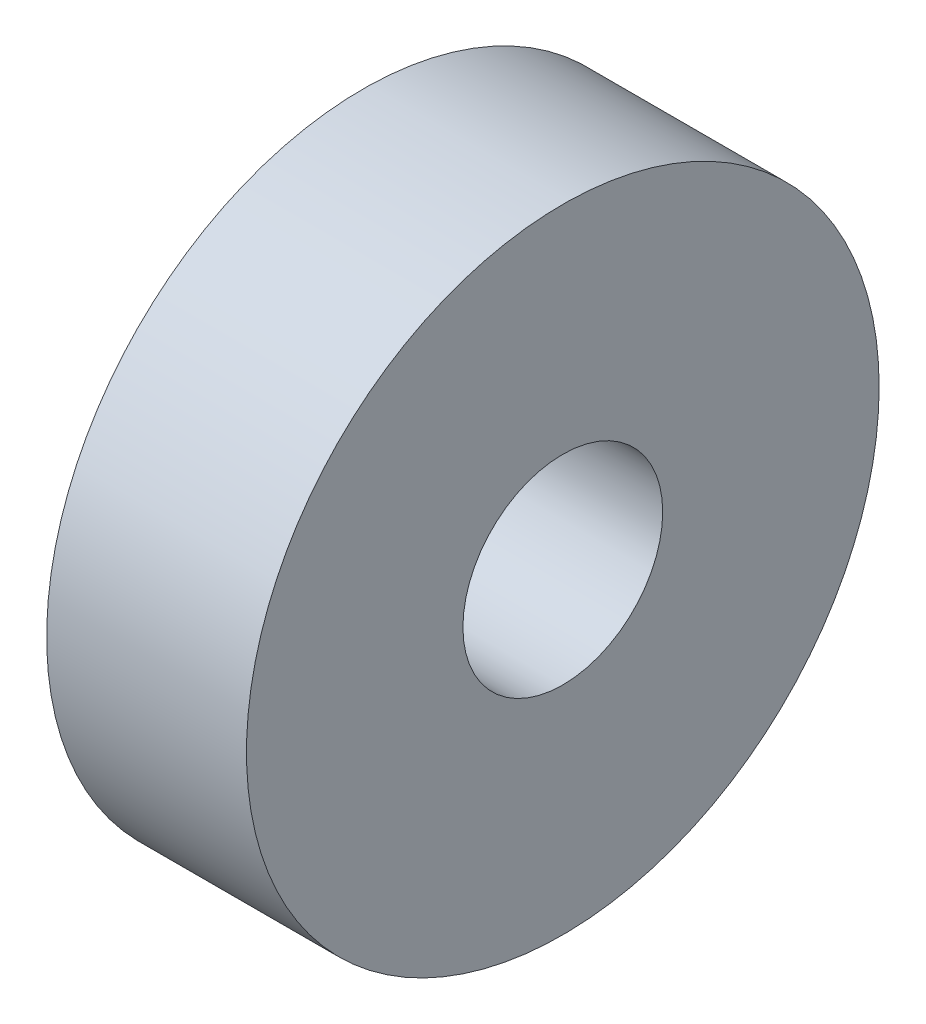
ISO-10303-21;
HEADER;
FILE_DESCRIPTION(('STEP AP214'),'2;1');
FILE_NAME('part.step','',(''),(''),'','','');
FILE_SCHEMA(('AUTOMOTIVE_DESIGN { 1 0 10303 214 1 1 1 1 }'));
ENDSEC;
DATA;
#1=APPLICATION_CONTEXT('core data for automotive mechanical design processes');
#2=APPLICATION_PROTOCOL_DEFINITION('international standard','automotive_design',2000,#1);
#3=PRODUCT_CONTEXT('',#1,'mechanical');
#4=PRODUCT('Part','Part','',(#3));
#5=PRODUCT_RELATED_PRODUCT_CATEGORY('part','',(#4));
#6=PRODUCT_DEFINITION_FORMATION('','',#4);
#7=PRODUCT_DEFINITION_CONTEXT('part definition',#1,'design');
#8=PRODUCT_DEFINITION('design','',#6,#7);
#9=PRODUCT_DEFINITION_SHAPE('','',#8);
#10=(LENGTH_UNIT() NAMED_UNIT(*) SI_UNIT(.MILLI.,.METRE.));
#11=(NAMED_UNIT(*) PLANE_ANGLE_UNIT() SI_UNIT($,.RADIAN.));
#12=(NAMED_UNIT(*) SI_UNIT($,.STERADIAN.) SOLID_ANGLE_UNIT());
#13=UNCERTAINTY_MEASURE_WITH_UNIT(LENGTH_MEASURE(1.E-05),#10,'distance_accuracy_value','');
#14=(GEOMETRIC_REPRESENTATION_CONTEXT(3) GLOBAL_UNCERTAINTY_ASSIGNED_CONTEXT((#13)) GLOBAL_UNIT_ASSIGNED_CONTEXT((#10,
#11,#12)) REPRESENTATION_CONTEXT('',''));
#15=CARTESIAN_POINT('',(0.,0.,0.));
#16=DIRECTION('',(0.,0.,1.));
#17=DIRECTION('',(1.,0.,0.));
#18=AXIS2_PLACEMENT_3D('',#15,#16,#17);
#19=CARTESIAN_POINT('',(6.,0.,0.));
#20=DIRECTION('',(1.,0.,0.));
#21=DIRECTION('',(0.,0.,-1.));
#22=AXIS2_PLACEMENT_3D('',#19,#20,#21);
#23=PLANE('',#22);
#24=CARTESIAN_POINT('',(6.,0.,0.));
#25=DIRECTION('',(1.,0.,0.));
#26=DIRECTION('',(0.,0.,-1.));
#27=AXIS2_PLACEMENT_3D('',#24,#25,#26);
#28=CIRCLE('',#27,9.5);
#29=CARTESIAN_POINT('',(6.,0.,-9.5));
#30=VERTEX_POINT('',#29);
#31=EDGE_CURVE('E10',#30,#30,#28,.T.);
#32=ORIENTED_EDGE('',*,*,#31,.T.);
#33=EDGE_LOOP('',(#32));
#34=FACE_BOUND('',#33,.T.);
#35=CARTESIAN_POINT('',(6.,0.,0.));
#36=DIRECTION('',(1.,0.,0.));
#37=DIRECTION('',(0.,0.,-1.));
#38=AXIS2_PLACEMENT_3D('',#35,#36,#37);
#39=CIRCLE('',#38,3.);
#40=CARTESIAN_POINT('',(6.,0.,-3.));
#41=VERTEX_POINT('',#40);
#42=EDGE_CURVE('E56',#41,#41,#39,.T.);
#43=ORIENTED_EDGE('',*,*,#42,.F.);
#44=EDGE_LOOP('',(#43));
#45=FACE_BOUND('',#44,.T.);
#46=ADVANCED_FACE('F43',(#34,#45),#23,.T.);
#47=CARTESIAN_POINT('',(0.,0.,0.));
#48=DIRECTION('',(1.,0.,0.));
#49=DIRECTION('',(0.,0.,-1.));
#50=AXIS2_PLACEMENT_3D('',#47,#48,#49);
#51=PLANE('',#50);
#52=CARTESIAN_POINT('',(0.,0.,0.));
#53=DIRECTION('',(1.,0.,0.));
#54=DIRECTION('',(0.,0.,-1.));
#55=AXIS2_PLACEMENT_3D('',#52,#53,#54);
#56=CIRCLE('',#55,9.5);
#57=CARTESIAN_POINT('',(0.,0.,-9.5));
#58=VERTEX_POINT('',#57);
#59=EDGE_CURVE('E47',#58,#58,#56,.T.);
#60=ORIENTED_EDGE('',*,*,#59,.F.);
#61=EDGE_LOOP('',(#60));
#62=FACE_BOUND('',#61,.T.);
#63=CARTESIAN_POINT('',(0.,0.,0.));
#64=DIRECTION('',(1.,0.,0.));
#65=DIRECTION('',(0.,0.,-1.));
#66=AXIS2_PLACEMENT_3D('',#63,#64,#65);
#67=CIRCLE('',#66,3.);
#68=CARTESIAN_POINT('',(0.,0.,-3.));
#69=VERTEX_POINT('',#68);
#70=EDGE_CURVE('E58',#69,#69,#67,.T.);
#71=ORIENTED_EDGE('',*,*,#70,.T.);
#72=EDGE_LOOP('',(#71));
#73=FACE_BOUND('',#72,.T.);
#74=ADVANCED_FACE('F70',(#62,#73),#51,.F.);
#75=CARTESIAN_POINT('',(6.,0.,0.));
#76=DIRECTION('',(-1.,0.,0.));
#77=DIRECTION('',(0.,0.,1.));
#78=AXIS2_PLACEMENT_3D('',#75,#76,#77);
#79=CYLINDRICAL_SURFACE('',#78,9.5);
#80=ORIENTED_EDGE('',*,*,#31,.F.);
#81=EDGE_LOOP('',(#80));
#82=FACE_BOUND('',#81,.T.);
#83=ORIENTED_EDGE('',*,*,#59,.T.);
#84=EDGE_LOOP('',(#83));
#85=FACE_BOUND('',#84,.T.);
#86=ADVANCED_FACE('F45',(#82,#85),#79,.T.);
#87=CARTESIAN_POINT('',(6.,0.,0.));
#88=DIRECTION('',(-1.,0.,0.));
#89=DIRECTION('',(0.,0.,1.));
#90=AXIS2_PLACEMENT_3D('',#87,#88,#89);
#91=CYLINDRICAL_SURFACE('',#90,3.);
#92=ORIENTED_EDGE('',*,*,#42,.T.);
#93=EDGE_LOOP('',(#92));
#94=FACE_BOUND('',#93,.T.);
#95=ORIENTED_EDGE('',*,*,#70,.F.);
#96=EDGE_LOOP('',(#95));
#97=FACE_BOUND('',#96,.T.);
#98=ADVANCED_FACE('F66',(#94,#97),#91,.F.);
#99=CLOSED_SHELL('',(#46,#74,#86,#98));
#100=MANIFOLD_SOLID_BREP('B2',#99);
#101=ADVANCED_BREP_SHAPE_REPRESENTATION('',(#18,#100),#14);
#102=SHAPE_DEFINITION_REPRESENTATION(#9,#101);
ENDSEC;
END-ISO-10303-21;
